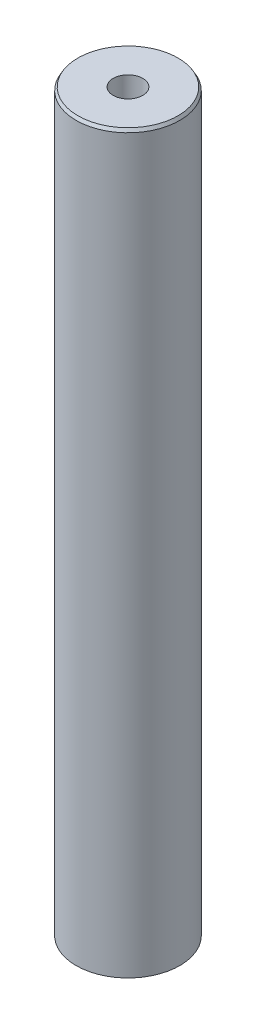
ISO-10303-21;
HEADER;
FILE_DESCRIPTION(('STEP AP214'),'2;1');
FILE_NAME('part.step','',(''),(''),'','','');
FILE_SCHEMA(('AUTOMOTIVE_DESIGN { 1 0 10303 214 1 1 1 1 }'));
ENDSEC;
DATA;
#1=APPLICATION_CONTEXT('core data for automotive mechanical design processes');
#2=APPLICATION_PROTOCOL_DEFINITION('international standard','automotive_design',2000,#1);
#3=PRODUCT_CONTEXT('',#1,'mechanical');
#4=PRODUCT('Part','Part','',(#3));
#5=PRODUCT_RELATED_PRODUCT_CATEGORY('part','',(#4));
#6=PRODUCT_DEFINITION_FORMATION('','',#4);
#7=PRODUCT_DEFINITION_CONTEXT('part definition',#1,'design');
#8=PRODUCT_DEFINITION('design','',#6,#7);
#9=PRODUCT_DEFINITION_SHAPE('','',#8);
#10=(LENGTH_UNIT() NAMED_UNIT(*) SI_UNIT(.MILLI.,.METRE.));
#11=(NAMED_UNIT(*) PLANE_ANGLE_UNIT() SI_UNIT($,.RADIAN.));
#12=(NAMED_UNIT(*) SI_UNIT($,.STERADIAN.) SOLID_ANGLE_UNIT());
#13=UNCERTAINTY_MEASURE_WITH_UNIT(LENGTH_MEASURE(1.E-05),#10,'distance_accuracy_value','');
#14=(GEOMETRIC_REPRESENTATION_CONTEXT(3) GLOBAL_UNCERTAINTY_ASSIGNED_CONTEXT((#13)) GLOBAL_UNIT_ASSIGNED_CONTEXT((#10,
#11,#12)) REPRESENTATION_CONTEXT('',''));
#15=CARTESIAN_POINT('',(0.,0.,0.));
#16=DIRECTION('',(0.,0.,1.));
#17=DIRECTION('',(1.,0.,0.));
#18=AXIS2_PLACEMENT_3D('',#15,#16,#17);
#19=CARTESIAN_POINT('',(0.,568.336679963864,0.));
#20=DIRECTION('',(0.,-1.,0.));
#21=DIRECTION('',(0.,0.,-1.));
#22=AXIS2_PLACEMENT_3D('',#19,#20,#21);
#23=CYLINDRICAL_SURFACE('',#22,40.);
#24=CARTESIAN_POINT('',(0.,565.938227259798,0.));
#25=DIRECTION('',(0.,1.,0.));
#26=DIRECTION('',(0.,0.,1.));
#27=AXIS2_PLACEMENT_3D('',#24,#25,#26);
#28=CIRCLE('',#27,40.);
#29=CARTESIAN_POINT('',(0.,565.938227259798,40.));
#30=VERTEX_POINT('',#29);
#31=EDGE_CURVE('E50',#30,#30,#28,.F.);
#32=ORIENTED_EDGE('',*,*,#31,.T.);
#33=EDGE_LOOP('',(#32));
#34=FACE_BOUND('',#33,.T.);
#35=CARTESIAN_POINT('',(0.,1.38474731433125,0.));
#36=DIRECTION('',(0.,1.,0.));
#37=DIRECTION('',(0.,0.,1.));
#38=AXIS2_PLACEMENT_3D('',#35,#36,#37);
#39=CIRCLE('',#38,40.);
#40=CARTESIAN_POINT('',(0.,1.38474731433125,40.));
#41=VERTEX_POINT('',#40);
#42=EDGE_CURVE('E51',#41,#41,#39,.T.);
#43=ORIENTED_EDGE('',*,*,#42,.T.);
#44=EDGE_LOOP('',(#43));
#45=FACE_BOUND('',#44,.T.);
#46=ADVANCED_FACE('F39',(#34,#45),#23,.T.);
#47=CARTESIAN_POINT('',(0.,568.336679963864,0.));
#48=DIRECTION('',(0.,1.,0.));
#49=DIRECTION('',(0.,0.,1.));
#50=AXIS2_PLACEMENT_3D('',#47,#48,#49);
#51=PLANE('',#50);
#52=CARTESIAN_POINT('',(0.,568.336679963864,0.));
#53=DIRECTION('',(0.,1.,0.));
#54=DIRECTION('',(0.,0.,1.));
#55=AXIS2_PLACEMENT_3D('',#52,#53,#54);
#56=CIRCLE('',#55,38.6152526856689);
#57=CARTESIAN_POINT('',(0.,568.336679963864,38.6152526856689));
#58=VERTEX_POINT('',#57);
#59=EDGE_CURVE('E54',#58,#58,#56,.T.);
#60=ORIENTED_EDGE('',*,*,#59,.T.);
#61=EDGE_LOOP('',(#60));
#62=FACE_BOUND('',#61,.T.);
#63=CARTESIAN_POINT('',(0.,568.336679963864,0.));
#64=DIRECTION('',(0.,1.,0.));
#65=DIRECTION('',(0.,0.,1.));
#66=AXIS2_PLACEMENT_3D('',#63,#64,#65);
#67=CIRCLE('',#66,11.4164120949129);
#68=CARTESIAN_POINT('',(0.,568.336679963864,11.4164120949129));
#69=VERTEX_POINT('',#68);
#70=EDGE_CURVE('E58',#69,#69,#67,.T.);
#71=ORIENTED_EDGE('',*,*,#70,.F.);
#72=EDGE_LOOP('',(#71));
#73=FACE_BOUND('',#72,.T.);
#74=ADVANCED_FACE('F69',(#62,#73),#51,.T.);
#75=CARTESIAN_POINT('',(0.,0.,0.));
#76=DIRECTION('',(0.,1.,0.));
#77=DIRECTION('',(0.,0.,1.));
#78=AXIS2_PLACEMENT_3D('',#75,#76,#77);
#79=PLANE('',#78);
#80=CARTESIAN_POINT('',(0.,0.,0.));
#81=DIRECTION('',(0.,1.,0.));
#82=DIRECTION('',(0.,0.,1.));
#83=AXIS2_PLACEMENT_3D('',#80,#81,#82);
#84=CIRCLE('',#83,37.6015472959339);
#85=CARTESIAN_POINT('',(0.,0.,37.6015472959339));
#86=VERTEX_POINT('',#85);
#87=EDGE_CURVE('E10',#86,#86,#84,.F.);
#88=ORIENTED_EDGE('',*,*,#87,.T.);
#89=EDGE_LOOP('',(#88));
#90=FACE_BOUND('',#89,.T.);
#91=CARTESIAN_POINT('',(0.,0.,0.));
#92=DIRECTION('',(0.,1.,0.));
#93=DIRECTION('',(0.,0.,1.));
#94=AXIS2_PLACEMENT_3D('',#91,#92,#93);
#95=CIRCLE('',#94,11.4164120949129);
#96=CARTESIAN_POINT('',(0.,0.,11.4164120949129));
#97=VERTEX_POINT('',#96);
#98=EDGE_CURVE('E63',#97,#97,#95,.T.);
#99=ORIENTED_EDGE('',*,*,#98,.T.);
#100=EDGE_LOOP('',(#99));
#101=FACE_BOUND('',#100,.T.);
#102=ADVANCED_FACE('F75',(#90,#101),#79,.F.);
#103=CARTESIAN_POINT('',(0.,568.336679963864,0.));
#104=DIRECTION('',(0.,-1.,0.));
#105=DIRECTION('',(0.,0.,-1.));
#106=AXIS2_PLACEMENT_3D('',#103,#104,#105);
#107=CYLINDRICAL_SURFACE('',#106,11.4164120949129);
#108=ORIENTED_EDGE('',*,*,#70,.T.);
#109=EDGE_LOOP('',(#108));
#110=FACE_BOUND('',#109,.T.);
#111=ORIENTED_EDGE('',*,*,#98,.F.);
#112=EDGE_LOOP('',(#111));
#113=FACE_BOUND('',#112,.T.);
#114=ADVANCED_FACE('F70',(#110,#113),#107,.F.);
#115=CARTESIAN_POINT('',(0.,568.336679963864,0.));
#116=DIRECTION('',(0.,-1.,0.));
#117=DIRECTION('',(0.,0.,-1.));
#118=AXIS2_PLACEMENT_3D('',#115,#116,#117);
#119=CONICAL_SURFACE('',#118,38.6152526856689,0.523598775598318);
#120=ORIENTED_EDGE('',*,*,#31,.F.);
#121=EDGE_LOOP('',(#120));
#122=FACE_BOUND('',#121,.T.);
#123=ORIENTED_EDGE('',*,*,#59,.F.);
#124=EDGE_LOOP('',(#123));
#125=FACE_BOUND('',#124,.T.);
#126=ADVANCED_FACE('F81',(#122,#125),#119,.T.);
#127=CARTESIAN_POINT('',(0.,1.38474731433125,0.));
#128=DIRECTION('',(0.,1.,0.));
#129=DIRECTION('',(0.,0.,1.));
#130=AXIS2_PLACEMENT_3D('',#127,#128,#129);
#131=CONICAL_SURFACE('',#130,40.,1.04719755119657);
#132=ORIENTED_EDGE('',*,*,#87,.F.);
#133=EDGE_LOOP('',(#132));
#134=FACE_BOUND('',#133,.T.);
#135=ORIENTED_EDGE('',*,*,#42,.F.);
#136=EDGE_LOOP('',(#135));
#137=FACE_BOUND('',#136,.T.);
#138=ADVANCED_FACE('F45',(#134,#137),#131,.T.);
#139=CLOSED_SHELL('',(#46,#74,#102,#114,#126,#138));
#140=MANIFOLD_SOLID_BREP('B2',#139);
#141=ADVANCED_BREP_SHAPE_REPRESENTATION('',(#18,#140),#14);
#142=SHAPE_DEFINITION_REPRESENTATION(#9,#141);
ENDSEC;
END-ISO-10303-21;
